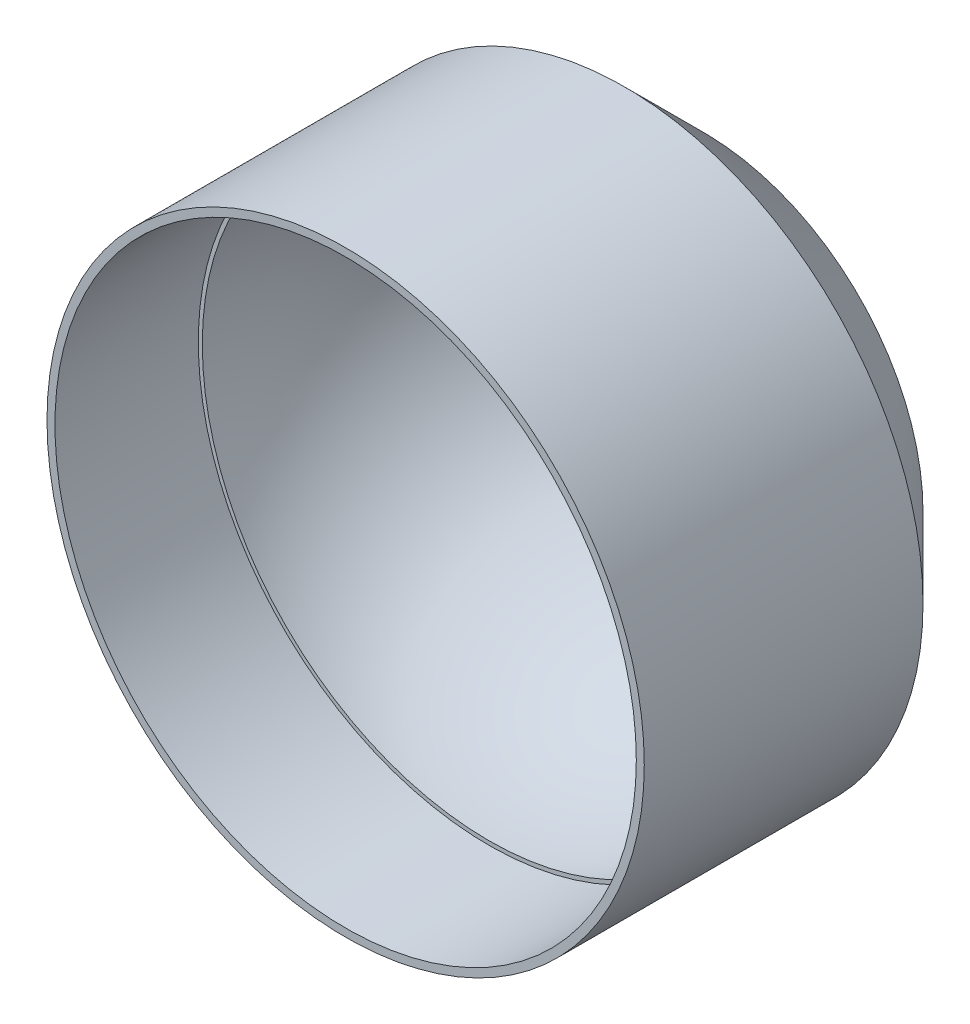
ISO-10303-21;
HEADER;
FILE_DESCRIPTION(('STEP AP214'),'2;1');
FILE_NAME('part.step','',(''),(''),'','','');
FILE_SCHEMA(('AUTOMOTIVE_DESIGN { 1 0 10303 214 1 1 1 1 }'));
ENDSEC;
DATA;
#1=APPLICATION_CONTEXT('core data for automotive mechanical design processes');
#2=APPLICATION_PROTOCOL_DEFINITION('international standard','automotive_design',2000,#1);
#3=PRODUCT_CONTEXT('',#1,'mechanical');
#4=PRODUCT('Part','Part','',(#3));
#5=PRODUCT_RELATED_PRODUCT_CATEGORY('part','',(#4));
#6=PRODUCT_DEFINITION_FORMATION('','',#4);
#7=PRODUCT_DEFINITION_CONTEXT('part definition',#1,'design');
#8=PRODUCT_DEFINITION('design','',#6,#7);
#9=PRODUCT_DEFINITION_SHAPE('','',#8);
#10=(LENGTH_UNIT() NAMED_UNIT(*) SI_UNIT(.MILLI.,.METRE.));
#11=(NAMED_UNIT(*) PLANE_ANGLE_UNIT() SI_UNIT($,.RADIAN.));
#12=(NAMED_UNIT(*) SI_UNIT($,.STERADIAN.) SOLID_ANGLE_UNIT());
#13=UNCERTAINTY_MEASURE_WITH_UNIT(LENGTH_MEASURE(1.E-05),#10,'distance_accuracy_value','');
#14=(GEOMETRIC_REPRESENTATION_CONTEXT(3) GLOBAL_UNCERTAINTY_ASSIGNED_CONTEXT((#13)) GLOBAL_UNIT_ASSIGNED_CONTEXT((#10,
#11,#12)) REPRESENTATION_CONTEXT('',''));
#15=CARTESIAN_POINT('',(0.,0.,0.));
#16=DIRECTION('',(0.,0.,1.));
#17=DIRECTION('',(1.,0.,0.));
#18=AXIS2_PLACEMENT_3D('',#15,#16,#17);
#19=CARTESIAN_POINT('',(0.,0.,45.));
#20=DIRECTION('',(0.,0.,-1.));
#21=DIRECTION('',(-1.,0.,0.));
#22=AXIS2_PLACEMENT_3D('',#19,#20,#21);
#23=CYLINDRICAL_SURFACE('',#22,37.5);
#24=CARTESIAN_POINT('',(0.,0.,10.0000000000001));
#25=DIRECTION('',(0.,0.,1.));
#26=DIRECTION('',(1.,0.,0.));
#27=AXIS2_PLACEMENT_3D('',#24,#25,#26);
#28=CIRCLE('',#27,37.5);
#29=CARTESIAN_POINT('',(37.5,0.,10.0000000000001));
#30=VERTEX_POINT('',#29);
#31=EDGE_CURVE('E43',#30,#30,#28,.T.);
#32=ORIENTED_EDGE('',*,*,#31,.T.);
#33=EDGE_LOOP('',(#32));
#34=FACE_BOUND('',#33,.T.);
#35=CARTESIAN_POINT('',(0.,0.,45.));
#36=DIRECTION('',(0.,0.,1.));
#37=DIRECTION('',(1.,0.,0.));
#38=AXIS2_PLACEMENT_3D('',#35,#36,#37);
#39=CIRCLE('',#38,37.5);
#40=CARTESIAN_POINT('',(37.5,0.,45.));
#41=VERTEX_POINT('',#40);
#42=EDGE_CURVE('E47',#41,#41,#39,.T.);
#43=ORIENTED_EDGE('',*,*,#42,.F.);
#44=EDGE_LOOP('',(#43));
#45=FACE_BOUND('',#44,.T.);
#46=ADVANCED_FACE('F35',(#34,#45),#23,.T.);
#47=CARTESIAN_POINT('',(0.,0.,45.));
#48=DIRECTION('',(0.,0.,1.));
#49=DIRECTION('',(1.,0.,0.));
#50=AXIS2_PLACEMENT_3D('',#47,#48,#49);
#51=PLANE('',#50);
#52=CARTESIAN_POINT('',(0.,0.,45.));
#53=DIRECTION('',(0.,0.,1.));
#54=DIRECTION('',(1.,0.,0.));
#55=AXIS2_PLACEMENT_3D('',#52,#53,#54);
#56=CIRCLE('',#55,36.5);
#57=CARTESIAN_POINT('',(36.5,0.,45.));
#58=VERTEX_POINT('',#57);
#59=EDGE_CURVE('E54',#58,#58,#56,.T.);
#60=ORIENTED_EDGE('',*,*,#59,.F.);
#61=EDGE_LOOP('',(#60));
#62=FACE_BOUND('',#61,.T.);
#63=ORIENTED_EDGE('',*,*,#42,.T.);
#64=EDGE_LOOP('',(#63));
#65=FACE_BOUND('',#64,.T.);
#66=ADVANCED_FACE('F78',(#62,#65),#51,.T.);
#67=CARTESIAN_POINT('',(0.,0.,0.));
#68=DIRECTION('',(0.,0.,1.));
#69=DIRECTION('',(1.,0.,0.));
#70=AXIS2_PLACEMENT_3D('',#67,#68,#69);
#71=PLANE('',#70);
#72=CARTESIAN_POINT('',(0.,0.,0.));
#73=DIRECTION('',(0.,0.,1.));
#74=DIRECTION('',(1.,0.,0.));
#75=AXIS2_PLACEMENT_3D('',#72,#73,#74);
#76=CIRCLE('',#75,27.4999999999999);
#77=CARTESIAN_POINT('',(27.4999999999999,0.,0.));
#78=VERTEX_POINT('',#77);
#79=EDGE_CURVE('E10',#78,#78,#76,.F.);
#80=ORIENTED_EDGE('',*,*,#79,.T.);
#81=EDGE_LOOP('',(#80));
#82=FACE_BOUND('',#81,.T.);
#83=CARTESIAN_POINT('',(0.,0.,0.));
#84=DIRECTION('',(0.,0.,1.));
#85=DIRECTION('',(1.,0.,0.));
#86=AXIS2_PLACEMENT_3D('',#83,#84,#85);
#87=CIRCLE('',#86,23.8117617995813);
#88=CARTESIAN_POINT('',(23.8117617995813,0.,0.));
#89=VERTEX_POINT('',#88);
#90=EDGE_CURVE('E57',#89,#89,#87,.T.);
#91=ORIENTED_EDGE('',*,*,#90,.T.);
#92=EDGE_LOOP('',(#91));
#93=FACE_BOUND('',#92,.T.);
#94=ADVANCED_FACE('F75',(#82,#93),#71,.F.);
#95=CARTESIAN_POINT('',(0.,0.,27.));
#96=DIRECTION('',(0.,0.,1.));
#97=DIRECTION('',(1.,0.,0.));
#98=AXIS2_PLACEMENT_3D('',#95,#96,#97);
#99=CYLINDRICAL_SURFACE('',#98,36.5);
#100=CARTESIAN_POINT('',(0.,0.,27.));
#101=DIRECTION('',(0.,0.,1.));
#102=DIRECTION('',(1.,0.,0.));
#103=AXIS2_PLACEMENT_3D('',#100,#101,#102);
#104=CIRCLE('',#103,36.5);
#105=CARTESIAN_POINT('',(36.5,0.,27.));
#106=VERTEX_POINT('',#105);
#107=EDGE_CURVE('E51',#106,#106,#104,.T.);
#108=ORIENTED_EDGE('',*,*,#107,.F.);
#109=EDGE_LOOP('',(#108));
#110=FACE_BOUND('',#109,.T.);
#111=ORIENTED_EDGE('',*,*,#59,.T.);
#112=EDGE_LOOP('',(#111));
#113=FACE_BOUND('',#112,.T.);
#114=ADVANCED_FACE('F77',(#110,#113),#99,.F.);
#115=CARTESIAN_POINT('',(0.,0.,27.));
#116=DIRECTION('',(0.,0.,1.));
#117=DIRECTION('',(1.,0.,0.));
#118=AXIS2_PLACEMENT_3D('',#115,#116,#117);
#119=PLANE('',#118);
#120=CARTESIAN_POINT('',(0.,0.,27.));
#121=DIRECTION('',(0.,0.,-1.));
#122=DIRECTION('',(-1.,0.,0.));
#123=AXIS2_PLACEMENT_3D('',#120,#121,#122);
#124=CIRCLE('',#123,36.);
#125=CARTESIAN_POINT('',(-36.,0.,27.));
#126=VERTEX_POINT('',#125);
#127=EDGE_CURVE('E62',#126,#126,#124,.T.);
#128=ORIENTED_EDGE('',*,*,#127,.T.);
#129=EDGE_LOOP('',(#128));
#130=FACE_BOUND('',#129,.T.);
#131=ORIENTED_EDGE('',*,*,#107,.T.);
#132=EDGE_LOOP('',(#131));
#133=FACE_BOUND('',#132,.T.);
#134=ADVANCED_FACE('F66',(#130,#133),#119,.T.);
#135=CARTESIAN_POINT('',(0.,0.,27.));
#136=DIRECTION('',(1.,0.,0.));
#137=DIRECTION('',(0.,-1.,0.));
#138=AXIS2_PLACEMENT_3D('',#135,#136,#137);
#139=SPHERICAL_SURFACE('',#138,36.);
#140=CARTESIAN_POINT('',(0.,0.,27.));
#141=DIRECTION('',(0.,0.,-1.));
#142=DIRECTION('',(-1.,0.,0.));
#143=AXIS2_PLACEMENT_3D('',#140,#141,#142);
#144=SPHERICAL_SURFACE('',#143,36.);
#145=ORIENTED_EDGE('',*,*,#127,.F.);
#146=EDGE_LOOP('',(#145));
#147=FACE_BOUND('',#146,.T.);
#148=ORIENTED_EDGE('',*,*,#90,.F.);
#149=EDGE_LOOP('',(#148));
#150=FACE_BOUND('',#149,.T.);
#151=ADVANCED_FACE('F69',(#147,#150),#144,.F.);
#152=CARTESIAN_POINT('',(0.,0.,10.0000000000001));
#153=DIRECTION('',(0.,0.,1.));
#154=DIRECTION('',(1.,0.,0.));
#155=AXIS2_PLACEMENT_3D('',#152,#153,#154);
#156=CONICAL_SURFACE('',#155,37.5,0.78539816339745);
#157=ORIENTED_EDGE('',*,*,#79,.F.);
#158=EDGE_LOOP('',(#157));
#159=FACE_BOUND('',#158,.T.);
#160=ORIENTED_EDGE('',*,*,#31,.F.);
#161=EDGE_LOOP('',(#160));
#162=FACE_BOUND('',#161,.T.);
#163=ADVANCED_FACE('F38',(#159,#162),#156,.T.);
#164=CLOSED_SHELL('',(#46,#66,#94,#114,#134,#151,#163));
#165=MANIFOLD_SOLID_BREP('B2',#164);
#166=ADVANCED_BREP_SHAPE_REPRESENTATION('',(#18,#165),#14);
#167=SHAPE_DEFINITION_REPRESENTATION(#9,#166);
ENDSEC;
END-ISO-10303-21;
